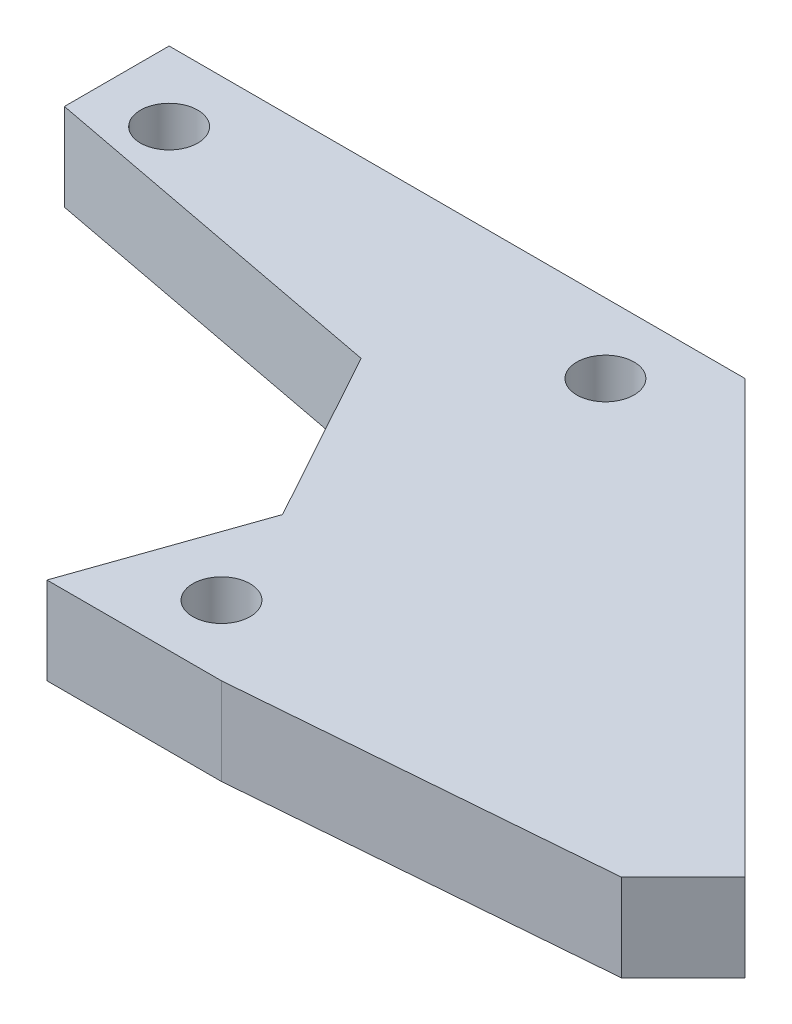
ISO-10303-21;
HEADER;
FILE_DESCRIPTION(('STEP AP214'),'2;1');
FILE_NAME('part.step','',(''),(''),'','','');
FILE_SCHEMA(('AUTOMOTIVE_DESIGN { 1 0 10303 214 1 1 1 1 }'));
ENDSEC;
DATA;
#1=APPLICATION_CONTEXT('core data for automotive mechanical design processes');
#2=APPLICATION_PROTOCOL_DEFINITION('international standard','automotive_design',2000,#1);
#3=PRODUCT_CONTEXT('',#1,'mechanical');
#4=PRODUCT('Part','Part','',(#3));
#5=PRODUCT_RELATED_PRODUCT_CATEGORY('part','',(#4));
#6=PRODUCT_DEFINITION_FORMATION('','',#4);
#7=PRODUCT_DEFINITION_CONTEXT('part definition',#1,'design');
#8=PRODUCT_DEFINITION('design','',#6,#7);
#9=PRODUCT_DEFINITION_SHAPE('','',#8);
#10=(LENGTH_UNIT() NAMED_UNIT(*) SI_UNIT(.MILLI.,.METRE.));
#11=(NAMED_UNIT(*) PLANE_ANGLE_UNIT() SI_UNIT($,.RADIAN.));
#12=(NAMED_UNIT(*) SI_UNIT($,.STERADIAN.) SOLID_ANGLE_UNIT());
#13=UNCERTAINTY_MEASURE_WITH_UNIT(LENGTH_MEASURE(1.E-05),#10,'distance_accuracy_value','');
#14=(GEOMETRIC_REPRESENTATION_CONTEXT(3) GLOBAL_UNCERTAINTY_ASSIGNED_CONTEXT((#13)) GLOBAL_UNIT_ASSIGNED_CONTEXT((#10,
#11,#12)) REPRESENTATION_CONTEXT('',''));
#15=CARTESIAN_POINT('',(0.,0.,0.));
#16=DIRECTION('',(0.,0.,1.));
#17=DIRECTION('',(1.,0.,0.));
#18=AXIS2_PLACEMENT_3D('',#15,#16,#17);
#19=CARTESIAN_POINT('',(0.,6.35,0.));
#20=DIRECTION('',(0.,1.,0.));
#21=DIRECTION('',(0.,0.,1.));
#22=AXIS2_PLACEMENT_3D('',#19,#20,#21);
#23=PLANE('',#22);
#24=CARTESIAN_POINT('',(26.67,6.35,-13.97));
#25=DIRECTION('',(0.,1.,0.));
#26=DIRECTION('',(0.,0.,1.));
#27=AXIS2_PLACEMENT_3D('',#24,#25,#26);
#28=CIRCLE('',#27,2.0828);
#29=CARTESIAN_POINT('',(26.67,6.35,-11.8872));
#30=VERTEX_POINT('',#29);
#31=EDGE_CURVE('E232',#30,#30,#28,.T.);
#32=ORIENTED_EDGE('',*,*,#31,.F.);
#33=EDGE_LOOP('',(#32));
#34=FACE_BOUND('',#33,.T.);
#35=DIRECTION('',(-1.,0.,0.));
#36=VECTOR('',#35,1.);
#37=CARTESIAN_POINT('',(21.59,6.35,-19.05));
#38=LINE('',#37,#36);
#39=CARTESIAN_POINT('',(63.5,6.35,-19.05));
#40=VERTEX_POINT('',#39);
#41=CARTESIAN_POINT('',(21.59,6.35,-19.05));
#42=VERTEX_POINT('',#41);
#43=EDGE_CURVE('E173',#40,#42,#38,.T.);
#44=ORIENTED_EDGE('',*,*,#43,.T.);
#45=DIRECTION('',(0.,0.,1.));
#46=VECTOR('',#45,1.);
#47=CARTESIAN_POINT('',(21.59,6.35,-11.43));
#48=LINE('',#47,#46);
#49=CARTESIAN_POINT('',(21.59,6.35,-11.43));
#50=VERTEX_POINT('',#49);
#51=EDGE_CURVE('E103',#42,#50,#48,.T.);
#52=ORIENTED_EDGE('',*,*,#51,.T.);
#53=DIRECTION('',(0.982338566422475,0.,0.187112107889995));
#54=VECTOR('',#53,1.);
#55=CARTESIAN_POINT('',(48.26,6.35,-6.34999999999998));
#56=LINE('',#55,#54);
#57=CARTESIAN_POINT('',(48.26,6.35,-6.34999999999998));
#58=VERTEX_POINT('',#57);
#59=EDGE_CURVE('E198',#50,#58,#56,.T.);
#60=ORIENTED_EDGE('',*,*,#59,.T.);
#61=DIRECTION('',(0.481918749772157,0.,0.876215908676647));
#62=VECTOR('',#61,1.);
#63=CARTESIAN_POINT('',(48.26,6.35,-6.34999999999998));
#64=LINE('',#63,#62);
#65=CARTESIAN_POINT('',(55.245,6.35,6.34999999999999));
#66=VERTEX_POINT('',#65);
#67=EDGE_CURVE('E216',#58,#66,#64,.T.);
#68=ORIENTED_EDGE('',*,*,#67,.T.);
#69=DIRECTION('',(-0.330350424728106,0.,0.943858356366018));
#70=VECTOR('',#69,1.);
#71=CARTESIAN_POINT('',(55.245,6.35,6.34999999999999));
#72=LINE('',#71,#70);
#73=CARTESIAN_POINT('',(50.8,6.35,19.05));
#74=VERTEX_POINT('',#73);
#75=EDGE_CURVE('E214',#66,#74,#72,.T.);
#76=ORIENTED_EDGE('',*,*,#75,.T.);
#77=DIRECTION('',(1.,0.,0.));
#78=VECTOR('',#77,1.);
#79=CARTESIAN_POINT('',(63.5,6.35,19.05));
#80=LINE('',#79,#78);
#81=CARTESIAN_POINT('',(63.5,6.35,19.05));
#82=VERTEX_POINT('',#81);
#83=EDGE_CURVE('E125',#74,#82,#80,.T.);
#84=ORIENTED_EDGE('',*,*,#83,.T.);
#85=DIRECTION('',(0.996745154549074,0.,-0.0806169763942036));
#86=VECTOR('',#85,1.);
#87=CARTESIAN_POINT('',(90.4407683632075,6.35,16.8710244842765));
#88=LINE('',#87,#86);
#89=CARTESIAN_POINT('',(90.4407683632075,6.35,16.8710244842765));
#90=VERTEX_POINT('',#89);
#91=EDGE_CURVE('E119',#82,#90,#88,.T.);
#92=ORIENTED_EDGE('',*,*,#91,.T.);
#93=DIRECTION('',(0.707106781186546,0.,-0.707106781186549));
#94=VECTOR('',#93,1.);
#95=CARTESIAN_POINT('',(90.4407683632075,6.35,16.8710244842765));
#96=LINE('',#95,#94);
#97=CARTESIAN_POINT('',(94.9308964237421,6.35,12.380896423742));
#98=VERTEX_POINT('',#97);
#99=EDGE_CURVE('E123',#90,#98,#96,.T.);
#100=ORIENTED_EDGE('',*,*,#99,.T.);
#101=DIRECTION('',(-0.707106781186549,0.,-0.707106781186546));
#102=VECTOR('',#101,1.);
#103=CARTESIAN_POINT('',(63.5,6.35,-19.05));
#104=LINE('',#103,#102);
#105=EDGE_CURVE('E57',#98,#40,#104,.T.);
#106=ORIENTED_EDGE('',*,*,#105,.T.);
#107=EDGE_LOOP('',(#44,#52,#60,#68,#76,#84,#92,#100,#106));
#108=FACE_BOUND('',#107,.T.);
#109=CARTESIAN_POINT('',(58.42,6.35,-13.97));
#110=DIRECTION('',(0.,1.,0.));
#111=DIRECTION('',(0.,0.,1.));
#112=AXIS2_PLACEMENT_3D('',#109,#110,#111);
#113=CIRCLE('',#112,2.0828);
#114=CARTESIAN_POINT('',(58.42,6.35,-11.8872));
#115=VERTEX_POINT('',#114);
#116=EDGE_CURVE('E152',#115,#115,#113,.T.);
#117=ORIENTED_EDGE('',*,*,#116,.F.);
#118=EDGE_LOOP('',(#117));
#119=FACE_BOUND('',#118,.T.);
#120=CARTESIAN_POINT('',(58.42,6.35,13.97));
#121=DIRECTION('',(0.,1.,0.));
#122=DIRECTION('',(0.,0.,1.));
#123=AXIS2_PLACEMENT_3D('',#120,#121,#122);
#124=CIRCLE('',#123,2.0828);
#125=CARTESIAN_POINT('',(58.42,6.35,16.0528));
#126=VERTEX_POINT('',#125);
#127=EDGE_CURVE('E240',#126,#126,#124,.T.);
#128=ORIENTED_EDGE('',*,*,#127,.F.);
#129=EDGE_LOOP('',(#128));
#130=FACE_BOUND('',#129,.T.);
#131=ADVANCED_FACE('F39',(#34,#108,#119,#130),#23,.T.);
#132=CARTESIAN_POINT('',(0.,0.,0.));
#133=DIRECTION('',(0.,1.,0.));
#134=DIRECTION('',(0.,0.,1.));
#135=AXIS2_PLACEMENT_3D('',#132,#133,#134);
#136=PLANE('',#135);
#137=DIRECTION('',(-1.,0.,0.));
#138=VECTOR('',#137,1.);
#139=CARTESIAN_POINT('',(21.59,0.,-19.05));
#140=LINE('',#139,#138);
#141=CARTESIAN_POINT('',(63.5,0.,-19.05));
#142=VERTEX_POINT('',#141);
#143=CARTESIAN_POINT('',(21.59,0.,-19.05));
#144=VERTEX_POINT('',#143);
#145=EDGE_CURVE('E147',#142,#144,#140,.T.);
#146=ORIENTED_EDGE('',*,*,#145,.F.);
#147=DIRECTION('',(-0.707106781186549,0.,-0.707106781186546));
#148=VECTOR('',#147,1.);
#149=CARTESIAN_POINT('',(63.5,0.,-19.05));
#150=LINE('',#149,#148);
#151=CARTESIAN_POINT('',(94.9308964237421,0.,12.380896423742));
#152=VERTEX_POINT('',#151);
#153=EDGE_CURVE('E95',#152,#142,#150,.T.);
#154=ORIENTED_EDGE('',*,*,#153,.F.);
#155=DIRECTION('',(0.707106781186546,0.,-0.707106781186549));
#156=VECTOR('',#155,1.);
#157=CARTESIAN_POINT('',(90.4407683632075,0.,16.8710244842765));
#158=LINE('',#157,#156);
#159=CARTESIAN_POINT('',(90.4407683632075,0.,16.8710244842765));
#160=VERTEX_POINT('',#159);
#161=EDGE_CURVE('E89',#160,#152,#158,.T.);
#162=ORIENTED_EDGE('',*,*,#161,.F.);
#163=DIRECTION('',(0.996745154549074,0.,-0.0806169763942036));
#164=VECTOR('',#163,1.);
#165=CARTESIAN_POINT('',(90.4407683632075,0.,16.8710244842765));
#166=LINE('',#165,#164);
#167=CARTESIAN_POINT('',(63.5,0.,19.05));
#168=VERTEX_POINT('',#167);
#169=EDGE_CURVE('E134',#168,#160,#166,.T.);
#170=ORIENTED_EDGE('',*,*,#169,.F.);
#171=DIRECTION('',(1.,0.,0.));
#172=VECTOR('',#171,1.);
#173=CARTESIAN_POINT('',(63.5,0.,19.05));
#174=LINE('',#173,#172);
#175=CARTESIAN_POINT('',(50.8,0.,19.05));
#176=VERTEX_POINT('',#175);
#177=EDGE_CURVE('E164',#176,#168,#174,.T.);
#178=ORIENTED_EDGE('',*,*,#177,.F.);
#179=DIRECTION('',(-0.330350424728106,0.,0.943858356366018));
#180=VECTOR('',#179,1.);
#181=CARTESIAN_POINT('',(55.245,0.,6.34999999999999));
#182=LINE('',#181,#180);
#183=CARTESIAN_POINT('',(55.245,0.,6.34999999999999));
#184=VERTEX_POINT('',#183);
#185=EDGE_CURVE('E161',#184,#176,#182,.T.);
#186=ORIENTED_EDGE('',*,*,#185,.F.);
#187=DIRECTION('',(0.481918749772157,0.,0.876215908676647));
#188=VECTOR('',#187,1.);
#189=CARTESIAN_POINT('',(48.26,0.,-6.34999999999998));
#190=LINE('',#189,#188);
#191=CARTESIAN_POINT('',(48.26,0.,-6.34999999999998));
#192=VERTEX_POINT('',#191);
#193=EDGE_CURVE('E158',#192,#184,#190,.T.);
#194=ORIENTED_EDGE('',*,*,#193,.F.);
#195=DIRECTION('',(0.982338566422475,0.,0.187112107889995));
#196=VECTOR('',#195,1.);
#197=CARTESIAN_POINT('',(48.26,0.,-6.34999999999998));
#198=LINE('',#197,#196);
#199=CARTESIAN_POINT('',(21.59,0.,-11.43));
#200=VERTEX_POINT('',#199);
#201=EDGE_CURVE('E155',#200,#192,#198,.T.);
#202=ORIENTED_EDGE('',*,*,#201,.F.);
#203=DIRECTION('',(0.,0.,1.));
#204=VECTOR('',#203,1.);
#205=CARTESIAN_POINT('',(21.59,0.,-11.43));
#206=LINE('',#205,#204);
#207=EDGE_CURVE('E151',#144,#200,#206,.T.);
#208=ORIENTED_EDGE('',*,*,#207,.F.);
#209=EDGE_LOOP('',(#146,#154,#162,#170,#178,#186,#194,#202,#208));
#210=FACE_BOUND('',#209,.T.);
#211=CARTESIAN_POINT('',(58.42,0.,-13.97));
#212=DIRECTION('',(0.,1.,0.));
#213=DIRECTION('',(0.,0.,1.));
#214=AXIS2_PLACEMENT_3D('',#211,#212,#213);
#215=CIRCLE('',#214,2.0828);
#216=CARTESIAN_POINT('',(58.42,0.,-11.8872));
#217=VERTEX_POINT('',#216);
#218=EDGE_CURVE('E228',#217,#217,#215,.T.);
#219=ORIENTED_EDGE('',*,*,#218,.T.);
#220=EDGE_LOOP('',(#219));
#221=FACE_BOUND('',#220,.T.);
#222=CARTESIAN_POINT('',(26.67,0.,-13.97));
#223=DIRECTION('',(0.,1.,0.));
#224=DIRECTION('',(0.,0.,1.));
#225=AXIS2_PLACEMENT_3D('',#222,#223,#224);
#226=CIRCLE('',#225,2.0828);
#227=CARTESIAN_POINT('',(26.67,0.,-11.8872));
#228=VERTEX_POINT('',#227);
#229=EDGE_CURVE('E236',#228,#228,#226,.T.);
#230=ORIENTED_EDGE('',*,*,#229,.T.);
#231=EDGE_LOOP('',(#230));
#232=FACE_BOUND('',#231,.T.);
#233=CARTESIAN_POINT('',(58.42,0.,13.97));
#234=DIRECTION('',(0.,1.,0.));
#235=DIRECTION('',(0.,0.,1.));
#236=AXIS2_PLACEMENT_3D('',#233,#234,#235);
#237=CIRCLE('',#236,2.0828);
#238=CARTESIAN_POINT('',(58.42,0.,16.0528));
#239=VERTEX_POINT('',#238);
#240=EDGE_CURVE('E244',#239,#239,#237,.T.);
#241=ORIENTED_EDGE('',*,*,#240,.T.);
#242=EDGE_LOOP('',(#241));
#243=FACE_BOUND('',#242,.T.);
#244=ADVANCED_FACE('F202',(#210,#221,#232,#243),#136,.F.);
#245=CARTESIAN_POINT('',(21.59,6.35,-19.05));
#246=DIRECTION('',(0.,0.,1.));
#247=DIRECTION('',(1.,0.,0.));
#248=AXIS2_PLACEMENT_3D('',#245,#246,#247);
#249=PLANE('',#248);
#250=ORIENTED_EDGE('',*,*,#145,.T.);
#251=DIRECTION('',(0.,-1.,0.));
#252=VECTOR('',#251,1.);
#253=CARTESIAN_POINT('',(21.59,6.35,-19.05));
#254=LINE('',#253,#252);
#255=EDGE_CURVE('E11',#42,#144,#254,.T.);
#256=ORIENTED_EDGE('',*,*,#255,.F.);
#257=ORIENTED_EDGE('',*,*,#43,.F.);
#258=DIRECTION('',(0.,-1.,0.));
#259=VECTOR('',#258,1.);
#260=CARTESIAN_POINT('',(63.5,6.35,-19.05));
#261=LINE('',#260,#259);
#262=EDGE_CURVE('E143',#40,#142,#261,.T.);
#263=ORIENTED_EDGE('',*,*,#262,.T.);
#264=EDGE_LOOP('',(#250,#256,#257,#263));
#265=FACE_BOUND('',#264,.T.);
#266=ADVANCED_FACE('F41',(#265),#249,.F.);
#267=CARTESIAN_POINT('',(21.59,6.35,-11.43));
#268=DIRECTION('',(1.,0.,0.));
#269=DIRECTION('',(0.,0.,-1.));
#270=AXIS2_PLACEMENT_3D('',#267,#268,#269);
#271=PLANE('',#270);
#272=ORIENTED_EDGE('',*,*,#207,.T.);
#273=DIRECTION('',(0.,-1.,0.));
#274=VECTOR('',#273,1.);
#275=CARTESIAN_POINT('',(21.59,6.35,-11.43));
#276=LINE('',#275,#274);
#277=EDGE_CURVE('E49',#50,#200,#276,.T.);
#278=ORIENTED_EDGE('',*,*,#277,.F.);
#279=ORIENTED_EDGE('',*,*,#51,.F.);
#280=ORIENTED_EDGE('',*,*,#255,.T.);
#281=EDGE_LOOP('',(#272,#278,#279,#280));
#282=FACE_BOUND('',#281,.T.);
#283=ADVANCED_FACE('F283',(#282),#271,.F.);
#284=CARTESIAN_POINT('',(48.26,6.35,-6.34999999999998));
#285=DIRECTION('',(0.187112107889995,0.,-0.982338566422475));
#286=DIRECTION('',(-0.982338566422475,0.,-0.187112107889995));
#287=AXIS2_PLACEMENT_3D('',#284,#285,#286);
#288=PLANE('',#287);
#289=ORIENTED_EDGE('',*,*,#201,.T.);
#290=DIRECTION('',(0.,-1.,0.));
#291=VECTOR('',#290,1.);
#292=CARTESIAN_POINT('',(48.26,6.35,-6.34999999999998));
#293=LINE('',#292,#291);
#294=EDGE_CURVE('E188',#58,#192,#293,.T.);
#295=ORIENTED_EDGE('',*,*,#294,.F.);
#296=ORIENTED_EDGE('',*,*,#59,.F.);
#297=ORIENTED_EDGE('',*,*,#277,.T.);
#298=EDGE_LOOP('',(#289,#295,#296,#297));
#299=FACE_BOUND('',#298,.T.);
#300=ADVANCED_FACE('F196',(#299),#288,.F.);
#301=CARTESIAN_POINT('',(48.26,6.35,-6.34999999999998));
#302=DIRECTION('',(0.876215908676647,0.,-0.481918749772157));
#303=DIRECTION('',(-0.481918749772157,0.,-0.876215908676647));
#304=AXIS2_PLACEMENT_3D('',#301,#302,#303);
#305=PLANE('',#304);
#306=ORIENTED_EDGE('',*,*,#193,.T.);
#307=DIRECTION('',(0.,-1.,0.));
#308=VECTOR('',#307,1.);
#309=CARTESIAN_POINT('',(55.245,6.35,6.34999999999999));
#310=LINE('',#309,#308);
#311=EDGE_CURVE('E184',#66,#184,#310,.T.);
#312=ORIENTED_EDGE('',*,*,#311,.F.);
#313=ORIENTED_EDGE('',*,*,#67,.F.);
#314=ORIENTED_EDGE('',*,*,#294,.T.);
#315=EDGE_LOOP('',(#306,#312,#313,#314));
#316=FACE_BOUND('',#315,.T.);
#317=ADVANCED_FACE('F208',(#316),#305,.F.);
#318=CARTESIAN_POINT('',(55.245,6.35,6.34999999999999));
#319=DIRECTION('',(0.943858356366017,0.,0.330350424728106));
#320=DIRECTION('',(0.330350424728106,0.,-0.943858356366018));
#321=AXIS2_PLACEMENT_3D('',#318,#319,#320);
#322=PLANE('',#321);
#323=ORIENTED_EDGE('',*,*,#185,.T.);
#324=DIRECTION('',(0.,-1.,0.));
#325=VECTOR('',#324,1.);
#326=CARTESIAN_POINT('',(50.8,6.35,19.05));
#327=LINE('',#326,#325);
#328=EDGE_CURVE('E180',#74,#176,#327,.T.);
#329=ORIENTED_EDGE('',*,*,#328,.F.);
#330=ORIENTED_EDGE('',*,*,#75,.F.);
#331=ORIENTED_EDGE('',*,*,#311,.T.);
#332=EDGE_LOOP('',(#323,#329,#330,#331));
#333=FACE_BOUND('',#332,.T.);
#334=ADVANCED_FACE('F212',(#333),#322,.F.);
#335=CARTESIAN_POINT('',(63.5,6.35,19.05));
#336=DIRECTION('',(0.,0.,-1.));
#337=DIRECTION('',(-1.,0.,0.));
#338=AXIS2_PLACEMENT_3D('',#335,#336,#337);
#339=PLANE('',#338);
#340=ORIENTED_EDGE('',*,*,#177,.T.);
#341=DIRECTION('',(0.,-1.,0.));
#342=VECTOR('',#341,1.);
#343=CARTESIAN_POINT('',(63.5,6.35,19.05));
#344=LINE('',#343,#342);
#345=EDGE_CURVE('E136',#82,#168,#344,.T.);
#346=ORIENTED_EDGE('',*,*,#345,.F.);
#347=ORIENTED_EDGE('',*,*,#83,.F.);
#348=ORIENTED_EDGE('',*,*,#328,.T.);
#349=EDGE_LOOP('',(#340,#346,#347,#348));
#350=FACE_BOUND('',#349,.T.);
#351=ADVANCED_FACE('F274',(#350),#339,.F.);
#352=CARTESIAN_POINT('',(90.4407683632075,6.35,16.8710244842765));
#353=DIRECTION('',(-0.0806169763942036,0.,-0.996745154549074));
#354=DIRECTION('',(-0.996745154549074,0.,0.0806169763942036));
#355=AXIS2_PLACEMENT_3D('',#352,#353,#354);
#356=PLANE('',#355);
#357=ORIENTED_EDGE('',*,*,#169,.T.);
#358=DIRECTION('',(0.,-1.,0.));
#359=VECTOR('',#358,1.);
#360=CARTESIAN_POINT('',(90.4407683632075,6.35,16.8710244842765));
#361=LINE('',#360,#359);
#362=EDGE_CURVE('E131',#90,#160,#361,.T.);
#363=ORIENTED_EDGE('',*,*,#362,.F.);
#364=ORIENTED_EDGE('',*,*,#91,.F.);
#365=ORIENTED_EDGE('',*,*,#345,.T.);
#366=EDGE_LOOP('',(#357,#363,#364,#365));
#367=FACE_BOUND('',#366,.T.);
#368=ADVANCED_FACE('F132',(#367),#356,.F.);
#369=CARTESIAN_POINT('',(90.4407683632075,6.35,16.8710244842765));
#370=DIRECTION('',(-0.707106781186549,0.,-0.707106781186546));
#371=DIRECTION('',(-0.707106781186546,0.,0.707106781186549));
#372=AXIS2_PLACEMENT_3D('',#369,#370,#371);
#373=PLANE('',#372);
#374=ORIENTED_EDGE('',*,*,#161,.T.);
#375=DIRECTION('',(0.,-1.,0.));
#376=VECTOR('',#375,1.);
#377=CARTESIAN_POINT('',(94.9308964237421,6.35,12.380896423742));
#378=LINE('',#377,#376);
#379=EDGE_CURVE('E137',#98,#152,#378,.T.);
#380=ORIENTED_EDGE('',*,*,#379,.F.);
#381=ORIENTED_EDGE('',*,*,#99,.F.);
#382=ORIENTED_EDGE('',*,*,#362,.T.);
#383=EDGE_LOOP('',(#374,#380,#381,#382));
#384=FACE_BOUND('',#383,.T.);
#385=ADVANCED_FACE('F139',(#384),#373,.F.);
#386=CARTESIAN_POINT('',(63.5,6.35,-19.05));
#387=DIRECTION('',(-0.707106781186546,0.,0.707106781186549));
#388=DIRECTION('',(0.707106781186549,0.,0.707106781186546));
#389=AXIS2_PLACEMENT_3D('',#386,#387,#388);
#390=PLANE('',#389);
#391=ORIENTED_EDGE('',*,*,#153,.T.);
#392=ORIENTED_EDGE('',*,*,#262,.F.);
#393=ORIENTED_EDGE('',*,*,#105,.F.);
#394=ORIENTED_EDGE('',*,*,#379,.T.);
#395=EDGE_LOOP('',(#391,#392,#393,#394));
#396=FACE_BOUND('',#395,.T.);
#397=ADVANCED_FACE('F267',(#396),#390,.F.);
#398=CARTESIAN_POINT('',(58.42,6.35,-13.97));
#399=DIRECTION('',(0.,-1.,0.));
#400=DIRECTION('',(0.,0.,-1.));
#401=AXIS2_PLACEMENT_3D('',#398,#399,#400);
#402=CYLINDRICAL_SURFACE('',#401,2.0828);
#403=ORIENTED_EDGE('',*,*,#116,.T.);
#404=EDGE_LOOP('',(#403));
#405=FACE_BOUND('',#404,.T.);
#406=ORIENTED_EDGE('',*,*,#218,.F.);
#407=EDGE_LOOP('',(#406));
#408=FACE_BOUND('',#407,.T.);
#409=ADVANCED_FACE('F264',(#405,#408),#402,.F.);
#410=CARTESIAN_POINT('',(26.67,6.35,-13.97));
#411=DIRECTION('',(0.,-1.,0.));
#412=DIRECTION('',(0.,0.,-1.));
#413=AXIS2_PLACEMENT_3D('',#410,#411,#412);
#414=CYLINDRICAL_SURFACE('',#413,2.0828);
#415=ORIENTED_EDGE('',*,*,#31,.T.);
#416=EDGE_LOOP('',(#415));
#417=FACE_BOUND('',#416,.T.);
#418=ORIENTED_EDGE('',*,*,#229,.F.);
#419=EDGE_LOOP('',(#418));
#420=FACE_BOUND('',#419,.T.);
#421=ADVANCED_FACE('F352',(#417,#420),#414,.F.);
#422=CARTESIAN_POINT('',(58.42,6.35,13.97));
#423=DIRECTION('',(0.,-1.,0.));
#424=DIRECTION('',(0.,0.,-1.));
#425=AXIS2_PLACEMENT_3D('',#422,#423,#424);
#426=CYLINDRICAL_SURFACE('',#425,2.0828);
#427=ORIENTED_EDGE('',*,*,#127,.T.);
#428=EDGE_LOOP('',(#427));
#429=FACE_BOUND('',#428,.T.);
#430=ORIENTED_EDGE('',*,*,#240,.F.);
#431=EDGE_LOOP('',(#430));
#432=FACE_BOUND('',#431,.T.);
#433=ADVANCED_FACE('F252',(#429,#432),#426,.F.);
#434=CLOSED_SHELL('',(#131,#244,#266,#283,#300,#317,#334,#351,#368,#385,#397,#409,#421,#433));
#435=MANIFOLD_SOLID_BREP('B2',#434);
#436=ADVANCED_BREP_SHAPE_REPRESENTATION('',(#18,#435),#14);
#437=SHAPE_DEFINITION_REPRESENTATION(#9,#436);
ENDSEC;
END-ISO-10303-21;
